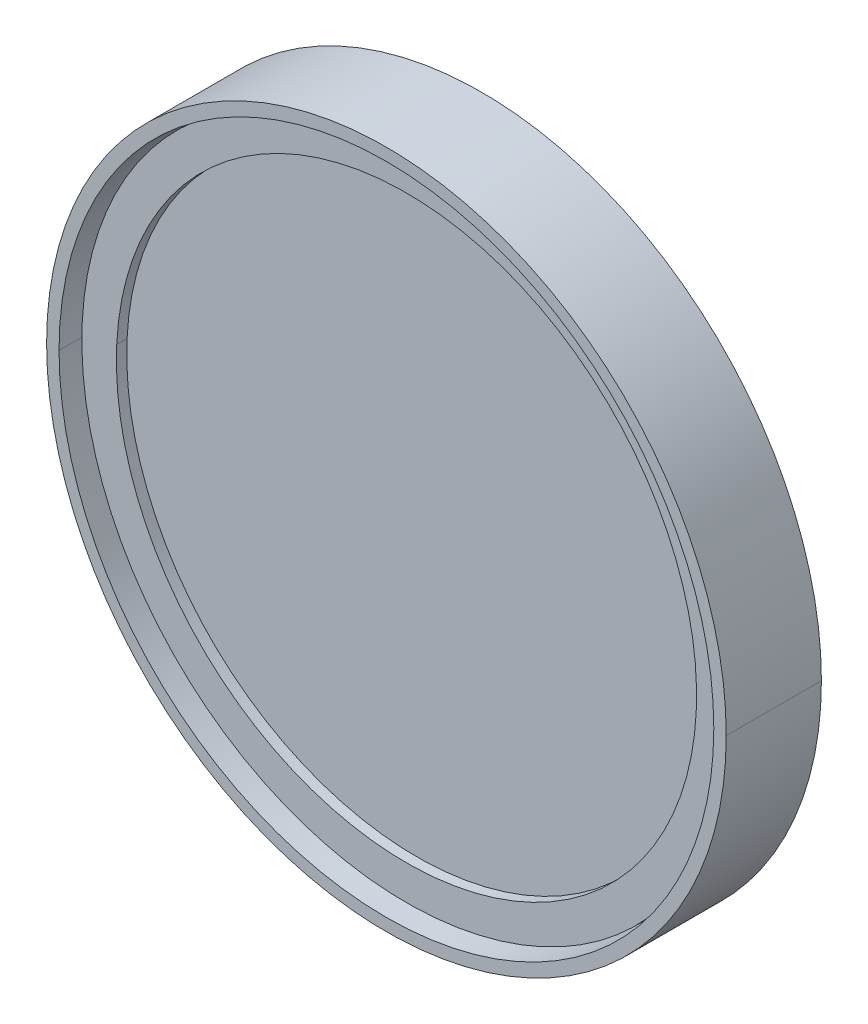
ISO-10303-21;
HEADER;
FILE_DESCRIPTION(('STEP AP214'),'2;1');
FILE_NAME('part.step','',(''),(''),'','','');
FILE_SCHEMA(('AUTOMOTIVE_DESIGN { 1 0 10303 214 1 1 1 1 }'));
ENDSEC;
DATA;
#1=APPLICATION_CONTEXT('core data for automotive mechanical design processes');
#2=APPLICATION_PROTOCOL_DEFINITION('international standard','automotive_design',2000,#1);
#3=PRODUCT_CONTEXT('',#1,'mechanical');
#4=PRODUCT('Part','Part','',(#3));
#5=PRODUCT_RELATED_PRODUCT_CATEGORY('part','',(#4));
#6=PRODUCT_DEFINITION_FORMATION('','',#4);
#7=PRODUCT_DEFINITION_CONTEXT('part definition',#1,'design');
#8=PRODUCT_DEFINITION('design','',#6,#7);
#9=PRODUCT_DEFINITION_SHAPE('','',#8);
#10=(LENGTH_UNIT() NAMED_UNIT(*) SI_UNIT(.MILLI.,.METRE.));
#11=(NAMED_UNIT(*) PLANE_ANGLE_UNIT() SI_UNIT($,.RADIAN.));
#12=(NAMED_UNIT(*) SI_UNIT($,.STERADIAN.) SOLID_ANGLE_UNIT());
#13=UNCERTAINTY_MEASURE_WITH_UNIT(LENGTH_MEASURE(1.E-05),#10,'distance_accuracy_value','');
#14=(GEOMETRIC_REPRESENTATION_CONTEXT(3) GLOBAL_UNCERTAINTY_ASSIGNED_CONTEXT((#13)) GLOBAL_UNIT_ASSIGNED_CONTEXT((#10,
#11,#12)) REPRESENTATION_CONTEXT('',''));
#15=CARTESIAN_POINT('',(0.,0.,0.));
#16=DIRECTION('',(0.,0.,1.));
#17=DIRECTION('',(1.,0.,0.));
#18=AXIS2_PLACEMENT_3D('',#15,#16,#17);
#19=CARTESIAN_POINT('',(0.,0.,2.381));
#20=DIRECTION('',(0.,0.,-1.));
#21=DIRECTION('',(-0.995743169136321,0.092171259719917,0.));
#22=AXIS2_PLACEMENT_3D('',#19,#20,#21);
#23=CYLINDRICAL_SURFACE('',#22,11.95);
#24=CARTESIAN_POINT('',(0.,0.,2.381));
#25=DIRECTION('',(0.,0.,1.));
#26=DIRECTION('',(0.995743169136321,-0.092171259719917,0.));
#27=AXIS2_PLACEMENT_3D('',#24,#25,#26);
#28=CIRCLE('',#27,11.95);
#29=CARTESIAN_POINT('',(11.899130871179,-1.10144655365301,2.381));
#30=VERTEX_POINT('',#29);
#31=CARTESIAN_POINT('',(-11.899130871179,1.10144655365301,2.381));
#32=VERTEX_POINT('',#31);
#33=EDGE_CURVE('P0_E41',#30,#32,#28,.T.);
#34=ORIENTED_EDGE('',*,*,#33,.F.);
#35=DIRECTION('',(0.,0.,-1.));
#36=VECTOR('',#35,1.);
#37=CARTESIAN_POINT('',(11.899130871179,-1.10144655365301,2.381));
#38=LINE('',#37,#36);
#39=CARTESIAN_POINT('',(11.899130871179,-1.10144655365301,0.381));
#40=VERTEX_POINT('',#39);
#41=EDGE_CURVE('P0_E11',#30,#40,#38,.T.);
#42=ORIENTED_EDGE('',*,*,#41,.T.);
#43=CARTESIAN_POINT('',(0.,0.,0.381));
#44=DIRECTION('',(0.,0.,1.));
#45=DIRECTION('',(0.995743169136321,-0.092171259719917,0.));
#46=AXIS2_PLACEMENT_3D('',#43,#44,#45);
#47=CIRCLE('',#46,11.95);
#48=CARTESIAN_POINT('',(-11.899130871179,1.10144655365301,0.381));
#49=VERTEX_POINT('',#48);
#50=EDGE_CURVE('P0_E28',#40,#49,#47,.T.);
#51=ORIENTED_EDGE('',*,*,#50,.T.);
#52=DIRECTION('',(0.,0.,-1.));
#53=VECTOR('',#52,1.);
#54=CARTESIAN_POINT('',(-11.899130871179,1.10144655365301,2.381));
#55=LINE('',#54,#53);
#56=EDGE_CURVE('P0_E55',#32,#49,#55,.T.);
#57=ORIENTED_EDGE('',*,*,#56,.F.);
#58=EDGE_LOOP('',(#34,#42,#51,#57));
#59=FACE_BOUND('',#58,.T.);
#60=ADVANCED_FACE('P0_F17',(#59),#23,.T.);
#61=CARTESIAN_POINT('',(0.,0.,2.381));
#62=DIRECTION('',(0.,0.,-1.));
#63=DIRECTION('',(-0.995743169136321,0.092171259719917,0.));
#64=AXIS2_PLACEMENT_3D('',#61,#62,#63);
#65=CYLINDRICAL_SURFACE('',#64,11.95);
#66=ORIENTED_EDGE('',*,*,#41,.F.);
#67=CARTESIAN_POINT('',(0.,0.,2.381));
#68=DIRECTION('',(0.,0.,1.));
#69=DIRECTION('',(0.995743169136321,-0.092171259719917,0.));
#70=AXIS2_PLACEMENT_3D('',#67,#68,#69);
#71=CIRCLE('',#70,11.95);
#72=EDGE_CURVE('P0_E63',#32,#30,#71,.T.);
#73=ORIENTED_EDGE('',*,*,#72,.F.);
#74=ORIENTED_EDGE('',*,*,#56,.T.);
#75=CARTESIAN_POINT('',(0.,0.,0.381));
#76=DIRECTION('',(0.,0.,1.));
#77=DIRECTION('',(0.995743169136321,-0.092171259719917,0.));
#78=AXIS2_PLACEMENT_3D('',#75,#76,#77);
#79=CIRCLE('',#78,11.95);
#80=EDGE_CURVE('P0_E21',#49,#40,#79,.T.);
#81=ORIENTED_EDGE('',*,*,#80,.T.);
#82=EDGE_LOOP('',(#66,#73,#74,#81));
#83=FACE_BOUND('',#82,.T.);
#84=ADVANCED_FACE('P0_F19',(#83),#65,.T.);
#85=CARTESIAN_POINT('',(0.,0.,2.381));
#86=DIRECTION('',(0.,0.,1.));
#87=DIRECTION('',(0.995743169136321,-0.092171259719917,0.));
#88=AXIS2_PLACEMENT_3D('',#85,#86,#87);
#89=PLANE('',#88);
#90=ORIENTED_EDGE('',*,*,#72,.T.);
#91=ORIENTED_EDGE('',*,*,#33,.T.);
#92=EDGE_LOOP('',(#90,#91));
#93=FACE_BOUND('',#92,.T.);
#94=ADVANCED_FACE('P0_F62',(#93),#89,.T.);
#95=CARTESIAN_POINT('',(0.,0.,0.381));
#96=DIRECTION('',(0.,0.,1.));
#97=DIRECTION('',(0.995743169136321,-0.092171259719917,0.));
#98=AXIS2_PLACEMENT_3D('',#95,#96,#97);
#99=PLANE('',#98);
#100=ORIENTED_EDGE('',*,*,#80,.F.);
#101=ORIENTED_EDGE('',*,*,#50,.F.);
#102=EDGE_LOOP('',(#100,#101));
#103=FACE_BOUND('',#102,.T.);
#104=ADVANCED_FACE('P0_F105',(#103),#99,.F.);
#105=CLOSED_SHELL('',(#60,#84,#94,#104));
#106=MANIFOLD_SOLID_BREP('P0_B1',#105);
#107=CARTESIAN_POINT('',(0.,0.,0.));
#108=DIRECTION('',(0.,0.,1.));
#109=DIRECTION('',(1.,0.,0.));
#110=AXIS2_PLACEMENT_3D('',#107,#108,#109);
#111=CYLINDRICAL_SURFACE('',#110,12.1031);
#112=CARTESIAN_POINT('',(0.,0.,0.381));
#113=DIRECTION('',(0.,0.,1.));
#114=DIRECTION('',(1.,0.,0.));
#115=AXIS2_PLACEMENT_3D('',#112,#113,#114);
#116=CIRCLE('',#115,12.1031);
#117=CARTESIAN_POINT('',(-12.1031,0.,0.381));
#118=VERTEX_POINT('',#117);
#119=CARTESIAN_POINT('',(12.1031,0.,0.381));
#120=VERTEX_POINT('',#119);
#121=EDGE_CURVE('P1_E41',#118,#120,#116,.T.);
#122=ORIENTED_EDGE('',*,*,#121,.F.);
#123=DIRECTION('',(0.,0.,1.));
#124=VECTOR('',#123,1.);
#125=CARTESIAN_POINT('',(-12.1031,0.,0.));
#126=LINE('',#125,#124);
#127=CARTESIAN_POINT('',(-12.1031,0.,0.6858));
#128=VERTEX_POINT('',#127);
#129=EDGE_CURVE('P1_E11',#118,#128,#126,.T.);
#130=ORIENTED_EDGE('',*,*,#129,.T.);
#131=CARTESIAN_POINT('',(0.,0.,0.6858));
#132=DIRECTION('',(0.,0.,1.));
#133=DIRECTION('',(1.,0.,0.));
#134=AXIS2_PLACEMENT_3D('',#131,#132,#133);
#135=CIRCLE('',#134,12.1031);
#136=CARTESIAN_POINT('',(12.1031,0.,0.6858));
#137=VERTEX_POINT('',#136);
#138=EDGE_CURVE('P1_E21',#128,#137,#135,.T.);
#139=ORIENTED_EDGE('',*,*,#138,.T.);
#140=DIRECTION('',(0.,0.,1.));
#141=VECTOR('',#140,1.);
#142=CARTESIAN_POINT('',(12.1031,0.,0.));
#143=LINE('',#142,#141);
#144=EDGE_CURVE('P1_E58',#120,#137,#143,.T.);
#145=ORIENTED_EDGE('',*,*,#144,.F.);
#146=EDGE_LOOP('',(#122,#130,#139,#145));
#147=FACE_BOUND('',#146,.T.);
#148=ADVANCED_FACE('P1_F17',(#147),#111,.F.);
#149=CARTESIAN_POINT('',(0.,0.,0.));
#150=DIRECTION('',(0.,0.,-1.));
#151=DIRECTION('',(-1.,0.,0.));
#152=AXIS2_PLACEMENT_3D('',#149,#150,#151);
#153=CYLINDRICAL_SURFACE('',#152,10.6045);
#154=CARTESIAN_POINT('',(0.,0.,0.381));
#155=DIRECTION('',(0.,0.,-1.));
#156=DIRECTION('',(-1.,0.,0.));
#157=AXIS2_PLACEMENT_3D('',#154,#155,#156);
#158=CIRCLE('',#157,10.6045);
#159=CARTESIAN_POINT('',(10.6045,0.,0.381));
#160=VERTEX_POINT('',#159);
#161=CARTESIAN_POINT('',(-10.6045,0.,0.381));
#162=VERTEX_POINT('',#161);
#163=EDGE_CURVE('P1_E167',#160,#162,#158,.T.);
#164=ORIENTED_EDGE('',*,*,#163,.F.);
#165=DIRECTION('',(0.,0.,-1.));
#166=VECTOR('',#165,1.);
#167=CARTESIAN_POINT('',(10.6045,0.,0.));
#168=LINE('',#167,#166);
#169=CARTESIAN_POINT('',(10.6045,0.,0.));
#170=VERTEX_POINT('',#169);
#171=EDGE_CURVE('P1_E223',#160,#170,#168,.T.);
#172=ORIENTED_EDGE('',*,*,#171,.T.);
#173=CARTESIAN_POINT('',(0.,0.,0.));
#174=DIRECTION('',(0.,0.,-1.));
#175=DIRECTION('',(-1.,0.,0.));
#176=AXIS2_PLACEMENT_3D('',#173,#174,#175);
#177=CIRCLE('',#176,10.6045);
#178=CARTESIAN_POINT('',(-10.6045,0.,0.));
#179=VERTEX_POINT('',#178);
#180=EDGE_CURVE('P1_E96',#170,#179,#177,.T.);
#181=ORIENTED_EDGE('',*,*,#180,.T.);
#182=DIRECTION('',(0.,0.,-1.));
#183=VECTOR('',#182,1.);
#184=CARTESIAN_POINT('',(-10.6045,0.,0.));
#185=LINE('',#184,#183);
#186=EDGE_CURVE('P1_E108',#162,#179,#185,.T.);
#187=ORIENTED_EDGE('',*,*,#186,.F.);
#188=EDGE_LOOP('',(#164,#172,#181,#187));
#189=FACE_BOUND('',#188,.T.);
#190=ADVANCED_FACE('P1_F260',(#189),#153,.F.);
#191=CARTESIAN_POINT('',(0.,0.,0.));
#192=DIRECTION('',(0.,0.,-1.));
#193=DIRECTION('',(-1.,0.,0.));
#194=AXIS2_PLACEMENT_3D('',#191,#192,#193);
#195=CYLINDRICAL_SURFACE('',#194,12.4968);
#196=CARTESIAN_POINT('',(0.,0.,3.5));
#197=DIRECTION('',(0.,0.,-1.));
#198=DIRECTION('',(-1.,0.,0.));
#199=AXIS2_PLACEMENT_3D('',#196,#197,#198);
#200=CIRCLE('',#199,12.4968);
#201=CARTESIAN_POINT('',(-12.4968,0.,3.5));
#202=VERTEX_POINT('',#201);
#203=CARTESIAN_POINT('',(12.4968,0.,3.5));
#204=VERTEX_POINT('',#203);
#205=EDGE_CURVE('P1_E164',#202,#204,#200,.T.);
#206=ORIENTED_EDGE('',*,*,#205,.T.);
#207=DIRECTION('',(0.,0.,-1.));
#208=VECTOR('',#207,1.);
#209=CARTESIAN_POINT('',(12.4968,0.,0.));
#210=LINE('',#209,#208);
#211=CARTESIAN_POINT('',(12.4968,0.,0.));
#212=VERTEX_POINT('',#211);
#213=EDGE_CURVE('P1_E160',#204,#212,#210,.T.);
#214=ORIENTED_EDGE('',*,*,#213,.T.);
#215=CARTESIAN_POINT('',(0.,0.,0.));
#216=DIRECTION('',(0.,0.,-1.));
#217=DIRECTION('',(-1.,0.,0.));
#218=AXIS2_PLACEMENT_3D('',#215,#216,#217);
#219=CIRCLE('',#218,12.4968);
#220=CARTESIAN_POINT('',(-12.4968,0.,0.));
#221=VERTEX_POINT('',#220);
#222=EDGE_CURVE('P1_E143',#221,#212,#219,.T.);
#223=ORIENTED_EDGE('',*,*,#222,.F.);
#224=DIRECTION('',(0.,0.,-1.));
#225=VECTOR('',#224,1.);
#226=CARTESIAN_POINT('',(-12.4968,0.,0.));
#227=LINE('',#226,#225);
#228=EDGE_CURVE('P1_E147',#202,#221,#227,.T.);
#229=ORIENTED_EDGE('',*,*,#228,.F.);
#230=EDGE_LOOP('',(#206,#214,#223,#229));
#231=FACE_BOUND('',#230,.T.);
#232=ADVANCED_FACE('P1_F203',(#231),#195,.T.);
#233=CARTESIAN_POINT('',(0.,0.,0.));
#234=DIRECTION('',(0.,0.,-1.));
#235=DIRECTION('',(-1.,0.,0.));
#236=AXIS2_PLACEMENT_3D('',#233,#234,#235);
#237=CYLINDRICAL_SURFACE('',#236,12.0396);
#238=CARTESIAN_POINT('',(0.,0.,3.5));
#239=DIRECTION('',(0.,0.,-1.));
#240=DIRECTION('',(-1.,0.,0.));
#241=AXIS2_PLACEMENT_3D('',#238,#239,#240);
#242=CIRCLE('',#241,12.0396);
#243=CARTESIAN_POINT('',(12.0396,0.,3.5));
#244=VERTEX_POINT('',#243);
#245=CARTESIAN_POINT('',(-12.0396,0.,3.5));
#246=VERTEX_POINT('',#245);
#247=EDGE_CURVE('P1_E128',#244,#246,#242,.T.);
#248=ORIENTED_EDGE('',*,*,#247,.F.);
#249=DIRECTION('',(0.,0.,-1.));
#250=VECTOR('',#249,1.);
#251=CARTESIAN_POINT('',(12.0396,0.,0.));
#252=LINE('',#251,#250);
#253=CARTESIAN_POINT('',(12.0396,0.,0.6858));
#254=VERTEX_POINT('',#253);
#255=EDGE_CURVE('P1_E142',#244,#254,#252,.T.);
#256=ORIENTED_EDGE('',*,*,#255,.T.);
#257=CARTESIAN_POINT('',(0.,0.,0.6858));
#258=DIRECTION('',(0.,0.,1.));
#259=DIRECTION('',(1.,0.,0.));
#260=AXIS2_PLACEMENT_3D('',#257,#258,#259);
#261=CIRCLE('',#260,12.0396);
#262=CARTESIAN_POINT('',(-12.0396,0.,0.6858));
#263=VERTEX_POINT('',#262);
#264=EDGE_CURVE('P1_E121',#263,#254,#261,.T.);
#265=ORIENTED_EDGE('',*,*,#264,.F.);
#266=DIRECTION('',(0.,0.,-1.));
#267=VECTOR('',#266,1.);
#268=CARTESIAN_POINT('',(-12.0396,0.,0.));
#269=LINE('',#268,#267);
#270=EDGE_CURVE('P1_E136',#246,#263,#269,.T.);
#271=ORIENTED_EDGE('',*,*,#270,.F.);
#272=EDGE_LOOP('',(#248,#256,#265,#271));
#273=FACE_BOUND('',#272,.T.);
#274=ADVANCED_FACE('P1_F137',(#273),#237,.F.);
#275=CARTESIAN_POINT('',(0.,0.,0.));
#276=DIRECTION('',(0.,0.,-1.));
#277=DIRECTION('',(-1.,0.,0.));
#278=AXIS2_PLACEMENT_3D('',#275,#276,#277);
#279=CYLINDRICAL_SURFACE('',#278,12.0396);
#280=ORIENTED_EDGE('',*,*,#255,.F.);
#281=CARTESIAN_POINT('',(0.,0.,3.5));
#282=DIRECTION('',(0.,0.,-1.));
#283=DIRECTION('',(-1.,0.,0.));
#284=AXIS2_PLACEMENT_3D('',#281,#282,#283);
#285=CIRCLE('',#284,12.0396);
#286=EDGE_CURVE('P1_E131',#246,#244,#285,.T.);
#287=ORIENTED_EDGE('',*,*,#286,.F.);
#288=ORIENTED_EDGE('',*,*,#270,.T.);
#289=CARTESIAN_POINT('',(0.,0.,0.6858));
#290=DIRECTION('',(0.,0.,1.));
#291=DIRECTION('',(1.,0.,0.));
#292=AXIS2_PLACEMENT_3D('',#289,#290,#291);
#293=CIRCLE('',#292,12.0396);
#294=EDGE_CURVE('P1_E172',#254,#263,#293,.T.);
#295=ORIENTED_EDGE('',*,*,#294,.F.);
#296=EDGE_LOOP('',(#280,#287,#288,#295));
#297=FACE_BOUND('',#296,.T.);
#298=ADVANCED_FACE('P1_F145',(#297),#279,.F.);
#299=CARTESIAN_POINT('',(0.,10.6045,0.));
#300=DIRECTION('',(0.,0.,-1.));
#301=DIRECTION('',(0.,-1.,0.));
#302=AXIS2_PLACEMENT_3D('',#299,#300,#301);
#303=PLANE('',#302);
#304=ORIENTED_EDGE('',*,*,#222,.T.);
#305=CARTESIAN_POINT('',(0.,0.,0.));
#306=DIRECTION('',(0.,0.,-1.));
#307=DIRECTION('',(-1.,0.,0.));
#308=AXIS2_PLACEMENT_3D('',#305,#306,#307);
#309=CIRCLE('',#308,12.4968);
#310=EDGE_CURVE('P1_E181',#212,#221,#309,.T.);
#311=ORIENTED_EDGE('',*,*,#310,.T.);
#312=EDGE_LOOP('',(#304,#311));
#313=FACE_BOUND('',#312,.T.);
#314=CARTESIAN_POINT('',(0.,0.,0.));
#315=DIRECTION('',(0.,0.,-1.));
#316=DIRECTION('',(-1.,0.,0.));
#317=AXIS2_PLACEMENT_3D('',#314,#315,#316);
#318=CIRCLE('',#317,10.6045);
#319=EDGE_CURVE('P1_E168',#179,#170,#318,.T.);
#320=ORIENTED_EDGE('',*,*,#319,.F.);
#321=ORIENTED_EDGE('',*,*,#180,.F.);
#322=EDGE_LOOP('',(#320,#321));
#323=FACE_BOUND('',#322,.T.);
#324=ADVANCED_FACE('P1_F198',(#313,#323),#303,.T.);
#325=CARTESIAN_POINT('',(0.,0.,0.));
#326=DIRECTION('',(0.,0.,-1.));
#327=DIRECTION('',(-1.,0.,0.));
#328=AXIS2_PLACEMENT_3D('',#325,#326,#327);
#329=CYLINDRICAL_SURFACE('',#328,12.4968);
#330=ORIENTED_EDGE('',*,*,#213,.F.);
#331=CARTESIAN_POINT('',(0.,0.,3.5));
#332=DIRECTION('',(0.,0.,-1.));
#333=DIRECTION('',(-1.,0.,0.));
#334=AXIS2_PLACEMENT_3D('',#331,#332,#333);
#335=CIRCLE('',#334,12.4968);
#336=EDGE_CURVE('P1_E153',#204,#202,#335,.T.);
#337=ORIENTED_EDGE('',*,*,#336,.T.);
#338=ORIENTED_EDGE('',*,*,#228,.T.);
#339=ORIENTED_EDGE('',*,*,#310,.F.);
#340=EDGE_LOOP('',(#330,#337,#338,#339));
#341=FACE_BOUND('',#340,.T.);
#342=ADVANCED_FACE('P1_F208',(#341),#329,.T.);
#343=CARTESIAN_POINT('',(0.,12.0396,3.5));
#344=DIRECTION('',(0.,0.,1.));
#345=DIRECTION('',(1.,0.,0.));
#346=AXIS2_PLACEMENT_3D('',#343,#344,#345);
#347=PLANE('',#346);
#348=ORIENTED_EDGE('',*,*,#205,.F.);
#349=ORIENTED_EDGE('',*,*,#336,.F.);
#350=EDGE_LOOP('',(#348,#349));
#351=FACE_BOUND('',#350,.T.);
#352=ORIENTED_EDGE('',*,*,#286,.T.);
#353=ORIENTED_EDGE('',*,*,#247,.T.);
#354=EDGE_LOOP('',(#352,#353));
#355=FACE_BOUND('',#354,.T.);
#356=ADVANCED_FACE('P1_F129',(#351,#355),#347,.T.);
#357=CARTESIAN_POINT('',(0.,10.6045,0.381));
#358=DIRECTION('',(0.,0.,1.));
#359=DIRECTION('',(1.,0.,0.));
#360=AXIS2_PLACEMENT_3D('',#357,#358,#359);
#361=PLANE('',#360);
#362=CARTESIAN_POINT('',(0.,0.,0.381));
#363=DIRECTION('',(0.,0.,1.));
#364=DIRECTION('',(1.,0.,0.));
#365=AXIS2_PLACEMENT_3D('',#362,#363,#364);
#366=CIRCLE('',#365,12.1031);
#367=EDGE_CURVE('P1_E134',#120,#118,#366,.T.);
#368=ORIENTED_EDGE('',*,*,#367,.T.);
#369=ORIENTED_EDGE('',*,*,#121,.T.);
#370=EDGE_LOOP('',(#368,#369));
#371=FACE_BOUND('',#370,.T.);
#372=CARTESIAN_POINT('',(0.,0.,0.381));
#373=DIRECTION('',(0.,0.,-1.));
#374=DIRECTION('',(-1.,0.,0.));
#375=AXIS2_PLACEMENT_3D('',#372,#373,#374);
#376=CIRCLE('',#375,10.6045);
#377=EDGE_CURVE('P1_E177',#162,#160,#376,.T.);
#378=ORIENTED_EDGE('',*,*,#377,.T.);
#379=ORIENTED_EDGE('',*,*,#163,.T.);
#380=EDGE_LOOP('',(#378,#379));
#381=FACE_BOUND('',#380,.T.);
#382=ADVANCED_FACE('P1_F267',(#371,#381),#361,.T.);
#383=CARTESIAN_POINT('',(0.,0.,0.));
#384=DIRECTION('',(0.,0.,-1.));
#385=DIRECTION('',(-1.,0.,0.));
#386=AXIS2_PLACEMENT_3D('',#383,#384,#385);
#387=CYLINDRICAL_SURFACE('',#386,10.6045);
#388=ORIENTED_EDGE('',*,*,#171,.F.);
#389=ORIENTED_EDGE('',*,*,#377,.F.);
#390=ORIENTED_EDGE('',*,*,#186,.T.);
#391=ORIENTED_EDGE('',*,*,#319,.T.);
#392=EDGE_LOOP('',(#388,#389,#390,#391));
#393=FACE_BOUND('',#392,.T.);
#394=ADVANCED_FACE('P1_F19',(#393),#387,.F.);
#395=CARTESIAN_POINT('',(0.,0.,0.));
#396=DIRECTION('',(0.,0.,1.));
#397=DIRECTION('',(1.,0.,0.));
#398=AXIS2_PLACEMENT_3D('',#395,#396,#397);
#399=CYLINDRICAL_SURFACE('',#398,12.1031);
#400=ORIENTED_EDGE('',*,*,#129,.F.);
#401=ORIENTED_EDGE('',*,*,#367,.F.);
#402=ORIENTED_EDGE('',*,*,#144,.T.);
#403=CARTESIAN_POINT('',(0.,0.,0.6858));
#404=DIRECTION('',(0.,0.,1.));
#405=DIRECTION('',(1.,0.,0.));
#406=AXIS2_PLACEMENT_3D('',#403,#404,#405);
#407=CIRCLE('',#406,12.1031);
#408=EDGE_CURVE('P1_E171',#137,#128,#407,.T.);
#409=ORIENTED_EDGE('',*,*,#408,.T.);
#410=EDGE_LOOP('',(#400,#401,#402,#409));
#411=FACE_BOUND('',#410,.T.);
#412=ADVANCED_FACE('P1_F275',(#411),#399,.F.);
#413=CARTESIAN_POINT('',(0.,12.0396,0.6858));
#414=DIRECTION('',(0.,0.,-1.));
#415=DIRECTION('',(0.,-1.,0.));
#416=AXIS2_PLACEMENT_3D('',#413,#414,#415);
#417=PLANE('',#416);
#418=ORIENTED_EDGE('',*,*,#408,.F.);
#419=ORIENTED_EDGE('',*,*,#138,.F.);
#420=EDGE_LOOP('',(#418,#419));
#421=FACE_BOUND('',#420,.T.);
#422=ORIENTED_EDGE('',*,*,#264,.T.);
#423=ORIENTED_EDGE('',*,*,#294,.T.);
#424=EDGE_LOOP('',(#422,#423));
#425=FACE_BOUND('',#424,.T.);
#426=ADVANCED_FACE('P1_F273',(#421,#425),#417,.T.);
#427=CLOSED_SHELL('',(#148,#190,#232,#274,#298,#324,#342,#356,#382,#394,#412,#426));
#428=MANIFOLD_SOLID_BREP('P1_B1',#427);
#429=CARTESIAN_POINT('',(0.,0.,2.381));
#430=DIRECTION('',(0.,0.,1.));
#431=DIRECTION('',(0.998824172296217,-0.048479612588971,0.));
#432=AXIS2_PLACEMENT_3D('',#429,#430,#431);
#433=CYLINDRICAL_SURFACE('',#432,10.668);
#434=CARTESIAN_POINT('',(0.,0.,2.381));
#435=DIRECTION('',(0.,0.,1.));
#436=DIRECTION('',(0.998824172296217,-0.048479612588971,0.));
#437=AXIS2_PLACEMENT_3D('',#434,#435,#436);
#438=CIRCLE('',#437,10.668);
#439=CARTESIAN_POINT('',(-10.655456270056,0.517180507099144,2.381));
#440=VERTEX_POINT('',#439);
#441=CARTESIAN_POINT('',(10.655456270056,-0.517180507099143,2.381));
#442=VERTEX_POINT('',#441);
#443=EDGE_CURVE('P2_E40',#440,#442,#438,.T.);
#444=ORIENTED_EDGE('',*,*,#443,.F.);
#445=DIRECTION('',(0.,0.,1.));
#446=VECTOR('',#445,1.);
#447=CARTESIAN_POINT('',(-10.655456270056,0.517180507099144,2.381));
#448=LINE('',#447,#446);
#449=CARTESIAN_POINT('',(-10.655456270056,0.517180507099144,2.762));
#450=VERTEX_POINT('',#449);
#451=EDGE_CURVE('P2_E10',#440,#450,#448,.T.);
#452=ORIENTED_EDGE('',*,*,#451,.T.);
#453=CARTESIAN_POINT('',(0.,0.,2.762));
#454=DIRECTION('',(0.,0.,1.));
#455=DIRECTION('',(0.998824172296217,-0.048479612588971,0.));
#456=AXIS2_PLACEMENT_3D('',#453,#454,#455);
#457=CIRCLE('',#456,10.668);
#458=CARTESIAN_POINT('',(10.655456270056,-0.517180507099143,2.762));
#459=VERTEX_POINT('',#458);
#460=EDGE_CURVE('P2_E20',#450,#459,#457,.T.);
#461=ORIENTED_EDGE('',*,*,#460,.T.);
#462=DIRECTION('',(0.,0.,1.));
#463=VECTOR('',#462,1.);
#464=CARTESIAN_POINT('',(10.655456270056,-0.517180507099143,2.381));
#465=LINE('',#464,#463);
#466=EDGE_CURVE('P2_E110',#442,#459,#465,.T.);
#467=ORIENTED_EDGE('',*,*,#466,.F.);
#468=EDGE_LOOP('',(#444,#452,#461,#467));
#469=FACE_BOUND('',#468,.T.);
#470=ADVANCED_FACE('P2_F16',(#469),#433,.F.);
#471=CARTESIAN_POINT('',(0.,0.,2.381));
#472=DIRECTION('',(0.,0.,1.));
#473=DIRECTION('',(0.998824172296217,-0.048479612588971,0.));
#474=AXIS2_PLACEMENT_3D('',#471,#472,#473);
#475=CYLINDRICAL_SURFACE('',#474,11.938);
#476=CARTESIAN_POINT('',(0.,0.,2.381));
#477=DIRECTION('',(0.,0.,1.));
#478=DIRECTION('',(0.998824172296217,-0.048479612588971,0.));
#479=AXIS2_PLACEMENT_3D('',#476,#477,#478);
#480=CIRCLE('',#479,11.938);
#481=CARTESIAN_POINT('',(11.9239629688722,-0.578749615087136,2.381));
#482=VERTEX_POINT('',#481);
#483=CARTESIAN_POINT('',(-11.9239629688722,0.578749615087137,2.381));
#484=VERTEX_POINT('',#483);
#485=EDGE_CURVE('P2_E80',#482,#484,#480,.T.);
#486=ORIENTED_EDGE('',*,*,#485,.T.);
#487=DIRECTION('',(0.,0.,1.));
#488=VECTOR('',#487,1.);
#489=CARTESIAN_POINT('',(-11.9239629688722,0.578749615087137,2.381));
#490=LINE('',#489,#488);
#491=CARTESIAN_POINT('',(-11.9239629688722,0.578749615087137,2.762));
#492=VERTEX_POINT('',#491);
#493=EDGE_CURVE('P2_E92',#484,#492,#490,.T.);
#494=ORIENTED_EDGE('',*,*,#493,.T.);
#495=CARTESIAN_POINT('',(0.,0.,2.762));
#496=DIRECTION('',(0.,0.,1.));
#497=DIRECTION('',(0.998824172296217,-0.048479612588971,0.));
#498=AXIS2_PLACEMENT_3D('',#495,#496,#497);
#499=CIRCLE('',#498,11.938);
#500=CARTESIAN_POINT('',(11.9239629688722,-0.578749615087136,2.762));
#501=VERTEX_POINT('',#500);
#502=EDGE_CURVE('P2_E65',#501,#492,#499,.T.);
#503=ORIENTED_EDGE('',*,*,#502,.F.);
#504=DIRECTION('',(0.,0.,1.));
#505=VECTOR('',#504,1.);
#506=CARTESIAN_POINT('',(11.9239629688722,-0.578749615087136,2.381));
#507=LINE('',#506,#505);
#508=EDGE_CURVE('P2_E77',#482,#501,#507,.T.);
#509=ORIENTED_EDGE('',*,*,#508,.F.);
#510=EDGE_LOOP('',(#486,#494,#503,#509));
#511=FACE_BOUND('',#510,.T.);
#512=ADVANCED_FACE('P2_F79',(#511),#475,.T.);
#513=CARTESIAN_POINT('',(0.,0.,2.381));
#514=DIRECTION('',(0.,0.,1.));
#515=DIRECTION('',(0.998824172296217,-0.048479612588971,0.));
#516=AXIS2_PLACEMENT_3D('',#513,#514,#515);
#517=CYLINDRICAL_SURFACE('',#516,11.938);
#518=ORIENTED_EDGE('',*,*,#493,.F.);
#519=CARTESIAN_POINT('',(0.,0.,2.381));
#520=DIRECTION('',(0.,0.,1.));
#521=DIRECTION('',(0.998824172296217,-0.048479612588971,0.));
#522=AXIS2_PLACEMENT_3D('',#519,#520,#521);
#523=CIRCLE('',#522,11.938);
#524=EDGE_CURVE('P2_E86',#484,#482,#523,.T.);
#525=ORIENTED_EDGE('',*,*,#524,.T.);
#526=ORIENTED_EDGE('',*,*,#508,.T.);
#527=CARTESIAN_POINT('',(0.,0.,2.762));
#528=DIRECTION('',(0.,0.,1.));
#529=DIRECTION('',(0.998824172296217,-0.048479612588971,0.));
#530=AXIS2_PLACEMENT_3D('',#527,#528,#529);
#531=CIRCLE('',#530,11.938);
#532=EDGE_CURVE('P2_E108',#492,#501,#531,.T.);
#533=ORIENTED_EDGE('',*,*,#532,.F.);
#534=EDGE_LOOP('',(#518,#525,#526,#533));
#535=FACE_BOUND('',#534,.T.);
#536=ADVANCED_FACE('P2_F94',(#535),#517,.T.);
#537=CARTESIAN_POINT('',(0.,0.,2.381));
#538=DIRECTION('',(0.,0.,1.));
#539=DIRECTION('',(0.998824172296217,-0.048479612588971,0.));
#540=AXIS2_PLACEMENT_3D('',#537,#538,#539);
#541=PLANE('',#540);
#542=ORIENTED_EDGE('',*,*,#485,.F.);
#543=ORIENTED_EDGE('',*,*,#524,.F.);
#544=EDGE_LOOP('',(#542,#543));
#545=FACE_BOUND('',#544,.T.);
#546=CARTESIAN_POINT('',(0.,0.,2.381));
#547=DIRECTION('',(0.,0.,1.));
#548=DIRECTION('',(0.998824172296217,-0.048479612588971,0.));
#549=AXIS2_PLACEMENT_3D('',#546,#547,#548);
#550=CIRCLE('',#549,10.668);
#551=EDGE_CURVE('P2_E87',#442,#440,#550,.T.);
#552=ORIENTED_EDGE('',*,*,#551,.T.);
#553=ORIENTED_EDGE('',*,*,#443,.T.);
#554=EDGE_LOOP('',(#552,#553));
#555=FACE_BOUND('',#554,.T.);
#556=ADVANCED_FACE('P2_F18',(#545,#555),#541,.F.);
#557=CARTESIAN_POINT('',(0.,0.,2.762));
#558=DIRECTION('',(0.,0.,1.));
#559=DIRECTION('',(0.998824172296217,-0.048479612588971,0.));
#560=AXIS2_PLACEMENT_3D('',#557,#558,#559);
#561=PLANE('',#560);
#562=ORIENTED_EDGE('',*,*,#502,.T.);
#563=ORIENTED_EDGE('',*,*,#532,.T.);
#564=EDGE_LOOP('',(#562,#563));
#565=FACE_BOUND('',#564,.T.);
#566=CARTESIAN_POINT('',(0.,0.,2.762));
#567=DIRECTION('',(0.,0.,1.));
#568=DIRECTION('',(0.998824172296217,-0.048479612588971,0.));
#569=AXIS2_PLACEMENT_3D('',#566,#567,#568);
#570=CIRCLE('',#569,10.668);
#571=EDGE_CURVE('P2_E105',#459,#450,#570,.T.);
#572=ORIENTED_EDGE('',*,*,#571,.F.);
#573=ORIENTED_EDGE('',*,*,#460,.F.);
#574=EDGE_LOOP('',(#572,#573));
#575=FACE_BOUND('',#574,.T.);
#576=ADVANCED_FACE('P2_F133',(#565,#575),#561,.T.);
#577=CARTESIAN_POINT('',(0.,0.,2.381));
#578=DIRECTION('',(0.,0.,1.));
#579=DIRECTION('',(0.998824172296217,-0.048479612588971,0.));
#580=AXIS2_PLACEMENT_3D('',#577,#578,#579);
#581=CYLINDRICAL_SURFACE('',#580,10.668);
#582=ORIENTED_EDGE('',*,*,#451,.F.);
#583=ORIENTED_EDGE('',*,*,#551,.F.);
#584=ORIENTED_EDGE('',*,*,#466,.T.);
#585=ORIENTED_EDGE('',*,*,#571,.T.);
#586=EDGE_LOOP('',(#582,#583,#584,#585));
#587=FACE_BOUND('',#586,.T.);
#588=ADVANCED_FACE('P2_F127',(#587),#581,.F.);
#589=CLOSED_SHELL('',(#470,#512,#536,#556,#576,#588));
#590=MANIFOLD_SOLID_BREP('P2_B1',#589);
#591=ADVANCED_BREP_SHAPE_REPRESENTATION('',(#18,#106,#428,#590),#14);
#592=SHAPE_DEFINITION_REPRESENTATION(#9,#591);
ENDSEC;
END-ISO-10303-21;
